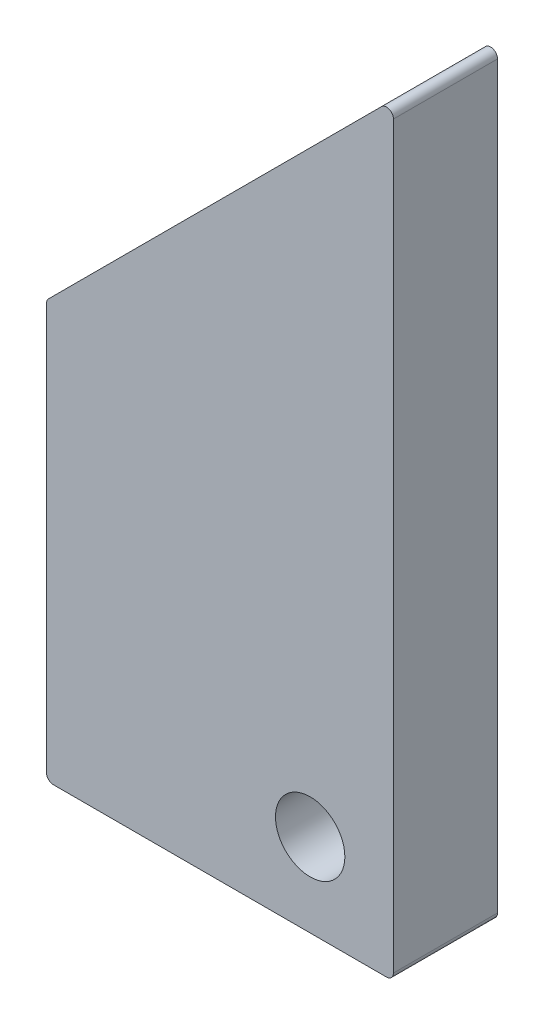
ISO-10303-21;
HEADER;
FILE_DESCRIPTION(('STEP AP214'),'2;1');
FILE_NAME('part.step','',(''),(''),'','','');
FILE_SCHEMA(('AUTOMOTIVE_DESIGN { 1 0 10303 214 1 1 1 1 }'));
ENDSEC;
DATA;
#1=APPLICATION_CONTEXT('core data for automotive mechanical design processes');
#2=APPLICATION_PROTOCOL_DEFINITION('international standard','automotive_design',2000,#1);
#3=PRODUCT_CONTEXT('',#1,'mechanical');
#4=PRODUCT('Part','Part','',(#3));
#5=PRODUCT_RELATED_PRODUCT_CATEGORY('part','',(#4));
#6=PRODUCT_DEFINITION_FORMATION('','',#4);
#7=PRODUCT_DEFINITION_CONTEXT('part definition',#1,'design');
#8=PRODUCT_DEFINITION('design','',#6,#7);
#9=PRODUCT_DEFINITION_SHAPE('','',#8);
#10=(LENGTH_UNIT() NAMED_UNIT(*) SI_UNIT(.MILLI.,.METRE.));
#11=(NAMED_UNIT(*) PLANE_ANGLE_UNIT() SI_UNIT($,.RADIAN.));
#12=(NAMED_UNIT(*) SI_UNIT($,.STERADIAN.) SOLID_ANGLE_UNIT());
#13=UNCERTAINTY_MEASURE_WITH_UNIT(LENGTH_MEASURE(1.E-05),#10,'distance_accuracy_value','');
#14=(GEOMETRIC_REPRESENTATION_CONTEXT(3) GLOBAL_UNCERTAINTY_ASSIGNED_CONTEXT((#13)) GLOBAL_UNIT_ASSIGNED_CONTEXT((#10,
#11,#12)) REPRESENTATION_CONTEXT('',''));
#15=CARTESIAN_POINT('',(0.,0.,0.));
#16=DIRECTION('',(0.,0.,1.));
#17=DIRECTION('',(1.,0.,0.));
#18=AXIS2_PLACEMENT_3D('',#15,#16,#17);
#19=CARTESIAN_POINT('',(0.,0.,15.));
#20=DIRECTION('',(0.,0.,1.));
#21=DIRECTION('',(1.,0.,0.));
#22=AXIS2_PLACEMENT_3D('',#19,#20,#21);
#23=PLANE('',#22);
#24=DIRECTION('',(0.,-1.,0.));
#25=VECTOR('',#24,1.);
#26=CARTESIAN_POINT('',(-50.,60.,15.));
#27=LINE('',#26,#25);
#28=CARTESIAN_POINT('',(-50.,59.5857864376269,15.));
#29=VERTEX_POINT('',#28);
#30=CARTESIAN_POINT('',(-50.,1.,15.));
#31=VERTEX_POINT('',#30);
#32=EDGE_CURVE('E144',#29,#31,#27,.T.);
#33=ORIENTED_EDGE('',*,*,#32,.T.);
#34=CARTESIAN_POINT('',(-49.,1.,15.));
#35=DIRECTION('',(0.,0.,1.));
#36=DIRECTION('',(1.,0.,0.));
#37=AXIS2_PLACEMENT_3D('',#34,#35,#36);
#38=CIRCLE('',#37,1.);
#39=CARTESIAN_POINT('',(-49.,0.,15.));
#40=VERTEX_POINT('',#39);
#41=EDGE_CURVE('E162',#31,#40,#38,.T.);
#42=ORIENTED_EDGE('',*,*,#41,.T.);
#43=DIRECTION('',(1.,0.,0.));
#44=VECTOR('',#43,1.);
#45=CARTESIAN_POINT('',(-50.,0.,15.));
#46=LINE('',#45,#44);
#47=CARTESIAN_POINT('',(-1.,0.,15.));
#48=VERTEX_POINT('',#47);
#49=EDGE_CURVE('E126',#40,#48,#46,.T.);
#50=ORIENTED_EDGE('',*,*,#49,.T.);
#51=CARTESIAN_POINT('',(-1.,1.,15.));
#52=DIRECTION('',(0.,0.,1.));
#53=DIRECTION('',(1.,0.,0.));
#54=AXIS2_PLACEMENT_3D('',#51,#52,#53);
#55=CIRCLE('',#54,1.);
#56=CARTESIAN_POINT('',(0.,1.,15.));
#57=VERTEX_POINT('',#56);
#58=EDGE_CURVE('E158',#48,#57,#55,.T.);
#59=ORIENTED_EDGE('',*,*,#58,.T.);
#60=DIRECTION('',(0.,1.,0.));
#61=VECTOR('',#60,1.);
#62=CARTESIAN_POINT('',(0.,0.,15.));
#63=LINE('',#62,#61);
#64=CARTESIAN_POINT('',(0.,107.585786437627,15.));
#65=VERTEX_POINT('',#64);
#66=EDGE_CURVE('E171',#57,#65,#63,.T.);
#67=ORIENTED_EDGE('',*,*,#66,.T.);
#68=CARTESIAN_POINT('',(-1.,107.585786437627,15.));
#69=DIRECTION('',(0.,0.,1.));
#70=DIRECTION('',(1.,0.,0.));
#71=AXIS2_PLACEMENT_3D('',#68,#69,#70);
#72=CIRCLE('',#71,1.);
#73=CARTESIAN_POINT('',(-1.70710678118655,108.292893218813,15.));
#74=VERTEX_POINT('',#73);
#75=EDGE_CURVE('E61',#65,#74,#72,.T.);
#76=ORIENTED_EDGE('',*,*,#75,.T.);
#77=DIRECTION('',(-0.707106781186547,-0.707106781186547,0.));
#78=VECTOR('',#77,1.);
#79=CARTESIAN_POINT('',(0.,110.,15.));
#80=LINE('',#79,#78);
#81=CARTESIAN_POINT('',(-49.7071067811865,60.2928932188135,15.));
#82=VERTEX_POINT('',#81);
#83=EDGE_CURVE('E177',#74,#82,#80,.T.);
#84=ORIENTED_EDGE('',*,*,#83,.T.);
#85=CARTESIAN_POINT('',(-49.,59.5857864376269,15.));
#86=DIRECTION('',(0.,0.,1.));
#87=DIRECTION('',(1.,0.,0.));
#88=AXIS2_PLACEMENT_3D('',#85,#86,#87);
#89=CIRCLE('',#88,1.);
#90=EDGE_CURVE('E160',#82,#29,#89,.T.);
#91=ORIENTED_EDGE('',*,*,#90,.T.);
#92=EDGE_LOOP('',(#33,#42,#50,#59,#67,#76,#84,#91));
#93=FACE_BOUND('',#92,.T.);
#94=CARTESIAN_POINT('',(-12.,12.,15.));
#95=DIRECTION('',(0.,0.,1.));
#96=DIRECTION('',(1.,0.,0.));
#97=AXIS2_PLACEMENT_3D('',#94,#95,#96);
#98=CIRCLE('',#97,5.);
#99=CARTESIAN_POINT('',(-7.,12.,15.));
#100=VERTEX_POINT('',#99);
#101=EDGE_CURVE('E135',#100,#100,#98,.T.);
#102=ORIENTED_EDGE('',*,*,#101,.F.);
#103=EDGE_LOOP('',(#102));
#104=FACE_BOUND('',#103,.T.);
#105=ADVANCED_FACE('F39',(#93,#104),#23,.T.);
#106=CARTESIAN_POINT('',(0.,0.,0.));
#107=DIRECTION('',(0.,0.,1.));
#108=DIRECTION('',(1.,0.,0.));
#109=AXIS2_PLACEMENT_3D('',#106,#107,#108);
#110=PLANE('',#109);
#111=DIRECTION('',(1.,0.,0.));
#112=VECTOR('',#111,1.);
#113=CARTESIAN_POINT('',(-50.,0.,0.));
#114=LINE('',#113,#112);
#115=CARTESIAN_POINT('',(-49.,0.,0.));
#116=VERTEX_POINT('',#115);
#117=CARTESIAN_POINT('',(-1.,0.,0.));
#118=VERTEX_POINT('',#117);
#119=EDGE_CURVE('E123',#116,#118,#114,.T.);
#120=ORIENTED_EDGE('',*,*,#119,.F.);
#121=CARTESIAN_POINT('',(-49.,1.,0.));
#122=DIRECTION('',(0.,0.,1.));
#123=DIRECTION('',(1.,0.,0.));
#124=AXIS2_PLACEMENT_3D('',#121,#122,#123);
#125=CIRCLE('',#124,1.);
#126=CARTESIAN_POINT('',(-50.,1.,0.));
#127=VERTEX_POINT('',#126);
#128=EDGE_CURVE('E106',#116,#127,#125,.F.);
#129=ORIENTED_EDGE('',*,*,#128,.T.);
#130=DIRECTION('',(0.,-1.,0.));
#131=VECTOR('',#130,1.);
#132=CARTESIAN_POINT('',(-50.,60.,0.));
#133=LINE('',#132,#131);
#134=CARTESIAN_POINT('',(-50.,59.5857864376269,0.));
#135=VERTEX_POINT('',#134);
#136=EDGE_CURVE('E148',#135,#127,#133,.T.);
#137=ORIENTED_EDGE('',*,*,#136,.F.);
#138=CARTESIAN_POINT('',(-49.,59.5857864376269,0.));
#139=DIRECTION('',(0.,0.,1.));
#140=DIRECTION('',(1.,0.,0.));
#141=AXIS2_PLACEMENT_3D('',#138,#139,#140);
#142=CIRCLE('',#141,1.);
#143=CARTESIAN_POINT('',(-49.7071067811865,60.2928932188135,0.));
#144=VERTEX_POINT('',#143);
#145=EDGE_CURVE('E117',#135,#144,#142,.F.);
#146=ORIENTED_EDGE('',*,*,#145,.T.);
#147=DIRECTION('',(-0.707106781186547,-0.707106781186547,0.));
#148=VECTOR('',#147,1.);
#149=CARTESIAN_POINT('',(0.,110.,0.));
#150=LINE('',#149,#148);
#151=CARTESIAN_POINT('',(-1.70710678118655,108.292893218813,0.));
#152=VERTEX_POINT('',#151);
#153=EDGE_CURVE('E138',#152,#144,#150,.T.);
#154=ORIENTED_EDGE('',*,*,#153,.F.);
#155=CARTESIAN_POINT('',(-1.,107.585786437627,0.));
#156=DIRECTION('',(0.,0.,1.));
#157=DIRECTION('',(1.,0.,0.));
#158=AXIS2_PLACEMENT_3D('',#155,#156,#157);
#159=CIRCLE('',#158,1.);
#160=CARTESIAN_POINT('',(0.,107.585786437627,0.));
#161=VERTEX_POINT('',#160);
#162=EDGE_CURVE('E127',#152,#161,#159,.F.);
#163=ORIENTED_EDGE('',*,*,#162,.T.);
#164=DIRECTION('',(0.,1.,0.));
#165=VECTOR('',#164,1.);
#166=CARTESIAN_POINT('',(0.,0.,0.));
#167=LINE('',#166,#165);
#168=CARTESIAN_POINT('',(0.,1.,0.));
#169=VERTEX_POINT('',#168);
#170=EDGE_CURVE('E134',#169,#161,#167,.T.);
#171=ORIENTED_EDGE('',*,*,#170,.F.);
#172=CARTESIAN_POINT('',(-1.,1.,0.));
#173=DIRECTION('',(0.,0.,1.));
#174=DIRECTION('',(1.,0.,0.));
#175=AXIS2_PLACEMENT_3D('',#172,#173,#174);
#176=CIRCLE('',#175,1.);
#177=EDGE_CURVE('E133',#169,#118,#176,.F.);
#178=ORIENTED_EDGE('',*,*,#177,.T.);
#179=EDGE_LOOP('',(#120,#129,#137,#146,#154,#163,#171,#178));
#180=FACE_BOUND('',#179,.T.);
#181=CARTESIAN_POINT('',(-12.,12.,0.));
#182=DIRECTION('',(0.,0.,1.));
#183=DIRECTION('',(1.,0.,0.));
#184=AXIS2_PLACEMENT_3D('',#181,#182,#183);
#185=CIRCLE('',#184,5.);
#186=CARTESIAN_POINT('',(-7.,12.,0.));
#187=VERTEX_POINT('',#186);
#188=EDGE_CURVE('E141',#187,#187,#185,.T.);
#189=ORIENTED_EDGE('',*,*,#188,.T.);
#190=EDGE_LOOP('',(#189));
#191=FACE_BOUND('',#190,.T.);
#192=ADVANCED_FACE('F130',(#180,#191),#110,.F.);
#193=CARTESIAN_POINT('',(-50.,0.,15.));
#194=DIRECTION('',(0.,1.,0.));
#195=DIRECTION('',(0.,0.,1.));
#196=AXIS2_PLACEMENT_3D('',#193,#194,#195);
#197=PLANE('',#196);
#198=ORIENTED_EDGE('',*,*,#49,.F.);
#199=DIRECTION('',(0.,0.,-1.));
#200=VECTOR('',#199,1.);
#201=CARTESIAN_POINT('',(-49.,0.,15.));
#202=LINE('',#201,#200);
#203=EDGE_CURVE('E110',#40,#116,#202,.T.);
#204=ORIENTED_EDGE('',*,*,#203,.T.);
#205=ORIENTED_EDGE('',*,*,#119,.T.);
#206=DIRECTION('',(0.,0.,-1.));
#207=VECTOR('',#206,1.);
#208=CARTESIAN_POINT('',(-1.,0.,15.));
#209=LINE('',#208,#207);
#210=EDGE_CURVE('E128',#118,#48,#209,.F.);
#211=ORIENTED_EDGE('',*,*,#210,.T.);
#212=EDGE_LOOP('',(#198,#204,#205,#211));
#213=FACE_BOUND('',#212,.T.);
#214=ADVANCED_FACE('F122',(#213),#197,.F.);
#215=CARTESIAN_POINT('',(0.,0.,15.));
#216=DIRECTION('',(-1.,0.,0.));
#217=DIRECTION('',(0.,0.,1.));
#218=AXIS2_PLACEMENT_3D('',#215,#216,#217);
#219=PLANE('',#218);
#220=ORIENTED_EDGE('',*,*,#66,.F.);
#221=DIRECTION('',(0.,0.,-1.));
#222=VECTOR('',#221,1.);
#223=CARTESIAN_POINT('',(0.,1.,15.));
#224=LINE('',#223,#222);
#225=EDGE_CURVE('E11',#57,#169,#224,.T.);
#226=ORIENTED_EDGE('',*,*,#225,.T.);
#227=ORIENTED_EDGE('',*,*,#170,.T.);
#228=DIRECTION('',(0.,0.,-1.));
#229=VECTOR('',#228,1.);
#230=CARTESIAN_POINT('',(0.,107.585786437627,15.));
#231=LINE('',#230,#229);
#232=EDGE_CURVE('E47',#161,#65,#231,.F.);
#233=ORIENTED_EDGE('',*,*,#232,.T.);
#234=EDGE_LOOP('',(#220,#226,#227,#233));
#235=FACE_BOUND('',#234,.T.);
#236=ADVANCED_FACE('F170',(#235),#219,.F.);
#237=CARTESIAN_POINT('',(0.,110.,15.));
#238=DIRECTION('',(0.707106781186547,-0.707106781186547,0.));
#239=DIRECTION('',(0.707106781186548,0.707106781186548,0.));
#240=AXIS2_PLACEMENT_3D('',#237,#238,#239);
#241=PLANE('',#240);
#242=ORIENTED_EDGE('',*,*,#153,.T.);
#243=DIRECTION('',(0.,0.,-1.));
#244=VECTOR('',#243,1.);
#245=CARTESIAN_POINT('',(-49.7071067811866,60.2928932188134,15.));
#246=LINE('',#245,#244);
#247=EDGE_CURVE('E54',#144,#82,#246,.F.);
#248=ORIENTED_EDGE('',*,*,#247,.T.);
#249=ORIENTED_EDGE('',*,*,#83,.F.);
#250=DIRECTION('',(0.,0.,-1.));
#251=VECTOR('',#250,1.);
#252=CARTESIAN_POINT('',(-1.70710678118655,108.292893218813,15.));
#253=LINE('',#252,#251);
#254=EDGE_CURVE('E164',#74,#152,#253,.T.);
#255=ORIENTED_EDGE('',*,*,#254,.T.);
#256=EDGE_LOOP('',(#242,#248,#249,#255));
#257=FACE_BOUND('',#256,.T.);
#258=ADVANCED_FACE('F181',(#257),#241,.F.);
#259=CARTESIAN_POINT('',(-50.,60.,15.));
#260=DIRECTION('',(1.,0.,0.));
#261=DIRECTION('',(0.,1.,0.));
#262=AXIS2_PLACEMENT_3D('',#259,#260,#261);
#263=PLANE('',#262);
#264=ORIENTED_EDGE('',*,*,#136,.T.);
#265=DIRECTION('',(0.,0.,-1.));
#266=VECTOR('',#265,1.);
#267=CARTESIAN_POINT('',(-50.,1.,15.));
#268=LINE('',#267,#266);
#269=EDGE_CURVE('E111',#127,#31,#268,.F.);
#270=ORIENTED_EDGE('',*,*,#269,.T.);
#271=ORIENTED_EDGE('',*,*,#32,.F.);
#272=DIRECTION('',(0.,0.,-1.));
#273=VECTOR('',#272,1.);
#274=CARTESIAN_POINT('',(-50.,59.5857864376269,15.));
#275=LINE('',#274,#273);
#276=EDGE_CURVE('E116',#29,#135,#275,.T.);
#277=ORIENTED_EDGE('',*,*,#276,.T.);
#278=EDGE_LOOP('',(#264,#270,#271,#277));
#279=FACE_BOUND('',#278,.T.);
#280=ADVANCED_FACE('F188',(#279),#263,.F.);
#281=CARTESIAN_POINT('',(-12.,12.,15.));
#282=DIRECTION('',(0.,0.,-1.));
#283=DIRECTION('',(-1.,0.,0.));
#284=AXIS2_PLACEMENT_3D('',#281,#282,#283);
#285=CYLINDRICAL_SURFACE('',#284,5.);
#286=ORIENTED_EDGE('',*,*,#101,.T.);
#287=EDGE_LOOP('',(#286));
#288=FACE_BOUND('',#287,.T.);
#289=ORIENTED_EDGE('',*,*,#188,.F.);
#290=EDGE_LOOP('',(#289));
#291=FACE_BOUND('',#290,.T.);
#292=ADVANCED_FACE('F194',(#288,#291),#285,.F.);
#293=CARTESIAN_POINT('',(-49.,1.,15.));
#294=DIRECTION('',(0.,0.,-1.));
#295=DIRECTION('',(-1.,0.,0.));
#296=AXIS2_PLACEMENT_3D('',#293,#294,#295);
#297=CYLINDRICAL_SURFACE('',#296,1.);
#298=ORIENTED_EDGE('',*,*,#41,.F.);
#299=ORIENTED_EDGE('',*,*,#269,.F.);
#300=ORIENTED_EDGE('',*,*,#128,.F.);
#301=ORIENTED_EDGE('',*,*,#203,.F.);
#302=EDGE_LOOP('',(#298,#299,#300,#301));
#303=FACE_BOUND('',#302,.T.);
#304=ADVANCED_FACE('F109',(#303),#297,.T.);
#305=CARTESIAN_POINT('',(-49.,59.5857864376269,15.));
#306=DIRECTION('',(0.,0.,-1.));
#307=DIRECTION('',(-1.,0.,0.));
#308=AXIS2_PLACEMENT_3D('',#305,#306,#307);
#309=CYLINDRICAL_SURFACE('',#308,1.);
#310=ORIENTED_EDGE('',*,*,#90,.F.);
#311=ORIENTED_EDGE('',*,*,#247,.F.);
#312=ORIENTED_EDGE('',*,*,#145,.F.);
#313=ORIENTED_EDGE('',*,*,#276,.F.);
#314=EDGE_LOOP('',(#310,#311,#312,#313));
#315=FACE_BOUND('',#314,.T.);
#316=ADVANCED_FACE('F185',(#315),#309,.T.);
#317=CARTESIAN_POINT('',(-1.,1.,15.));
#318=DIRECTION('',(0.,0.,-1.));
#319=DIRECTION('',(-1.,0.,0.));
#320=AXIS2_PLACEMENT_3D('',#317,#318,#319);
#321=CYLINDRICAL_SURFACE('',#320,1.);
#322=ORIENTED_EDGE('',*,*,#58,.F.);
#323=ORIENTED_EDGE('',*,*,#210,.F.);
#324=ORIENTED_EDGE('',*,*,#177,.F.);
#325=ORIENTED_EDGE('',*,*,#225,.F.);
#326=EDGE_LOOP('',(#322,#323,#324,#325));
#327=FACE_BOUND('',#326,.T.);
#328=ADVANCED_FACE('F218',(#327),#321,.T.);
#329=CARTESIAN_POINT('',(-1.,107.585786437627,15.));
#330=DIRECTION('',(0.,0.,-1.));
#331=DIRECTION('',(-1.,0.,0.));
#332=AXIS2_PLACEMENT_3D('',#329,#330,#331);
#333=CYLINDRICAL_SURFACE('',#332,1.);
#334=ORIENTED_EDGE('',*,*,#75,.F.);
#335=ORIENTED_EDGE('',*,*,#232,.F.);
#336=ORIENTED_EDGE('',*,*,#162,.F.);
#337=ORIENTED_EDGE('',*,*,#254,.F.);
#338=EDGE_LOOP('',(#334,#335,#336,#337));
#339=FACE_BOUND('',#338,.T.);
#340=ADVANCED_FACE('F41',(#339),#333,.T.);
#341=CLOSED_SHELL('',(#105,#192,#214,#236,#258,#280,#292,#304,#316,#328,#340));
#342=MANIFOLD_SOLID_BREP('B2',#341);
#343=ADVANCED_BREP_SHAPE_REPRESENTATION('',(#18,#342),#14);
#344=SHAPE_DEFINITION_REPRESENTATION(#9,#343);
ENDSEC;
END-ISO-10303-21;
